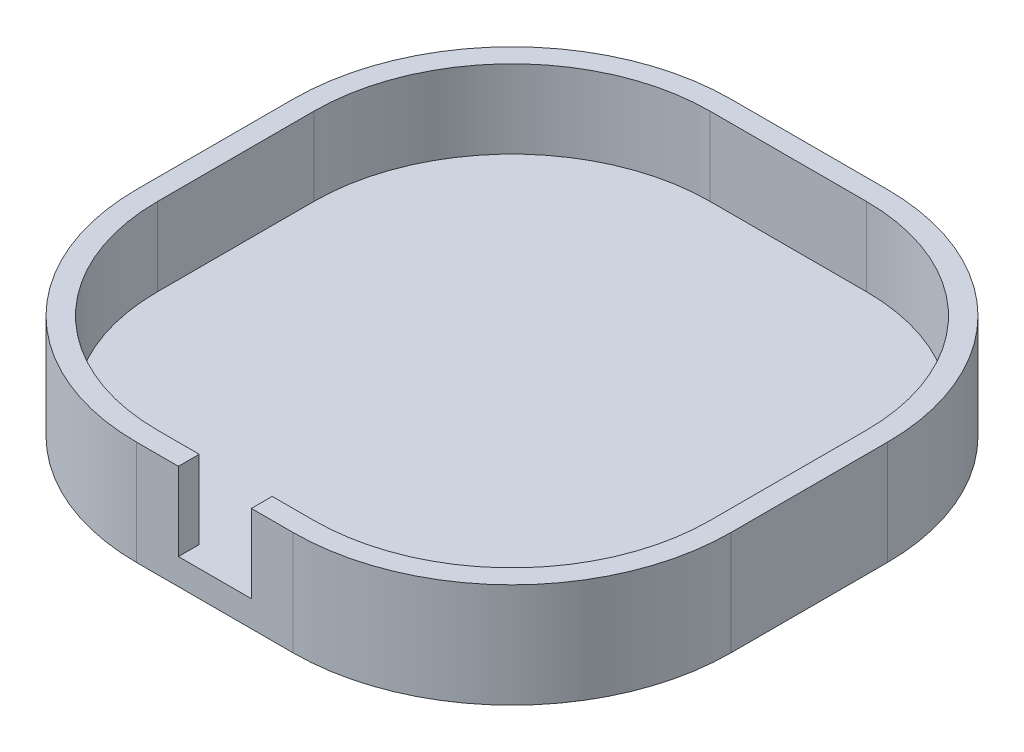
ISO-10303-21;
HEADER;
FILE_DESCRIPTION(('STEP AP214'),'2;1');
FILE_NAME('part.step','',(''),(''),'','','');
FILE_SCHEMA(('AUTOMOTIVE_DESIGN { 1 0 10303 214 1 1 1 1 }'));
ENDSEC;
DATA;
#1=APPLICATION_CONTEXT('core data for automotive mechanical design processes');
#2=APPLICATION_PROTOCOL_DEFINITION('international standard','automotive_design',2000,#1);
#3=PRODUCT_CONTEXT('',#1,'mechanical');
#4=PRODUCT('Part','Part','',(#3));
#5=PRODUCT_RELATED_PRODUCT_CATEGORY('part','',(#4));
#6=PRODUCT_DEFINITION_FORMATION('','',#4);
#7=PRODUCT_DEFINITION_CONTEXT('part definition',#1,'design');
#8=PRODUCT_DEFINITION('design','',#6,#7);
#9=PRODUCT_DEFINITION_SHAPE('','',#8);
#10=(LENGTH_UNIT() NAMED_UNIT(*) SI_UNIT(.MILLI.,.METRE.));
#11=(NAMED_UNIT(*) PLANE_ANGLE_UNIT() SI_UNIT($,.RADIAN.));
#12=(NAMED_UNIT(*) SI_UNIT($,.STERADIAN.) SOLID_ANGLE_UNIT());
#13=UNCERTAINTY_MEASURE_WITH_UNIT(LENGTH_MEASURE(1.E-05),#10,'distance_accuracy_value','');
#14=(GEOMETRIC_REPRESENTATION_CONTEXT(3) GLOBAL_UNCERTAINTY_ASSIGNED_CONTEXT((#13)) GLOBAL_UNIT_ASSIGNED_CONTEXT((#10,
#11,#12)) REPRESENTATION_CONTEXT('',''));
#15=CARTESIAN_POINT('',(0.,0.,0.));
#16=DIRECTION('',(0.,0.,1.));
#17=DIRECTION('',(1.,0.,0.));
#18=AXIS2_PLACEMENT_3D('',#15,#16,#17);
#19=CARTESIAN_POINT('',(-15.,20.,53.));
#20=DIRECTION('',(0.,0.,-1.));
#21=DIRECTION('',(-1.,0.,0.));
#22=AXIS2_PLACEMENT_3D('',#19,#20,#21);
#23=PLANE('',#22);
#24=DIRECTION('',(0.,1.,0.));
#25=VECTOR('',#24,1.);
#26=CARTESIAN_POINT('',(7.00000000000001,-9.56021977856105,53.));
#27=LINE('',#26,#25);
#28=CARTESIAN_POINT('',(7.00000000000001,5.,53.));
#29=VERTEX_POINT('',#28);
#30=CARTESIAN_POINT('',(7.00000000000001,20.,53.));
#31=VERTEX_POINT('',#30);
#32=EDGE_CURVE('E174',#29,#31,#27,.T.);
#33=ORIENTED_EDGE('',*,*,#32,.T.);
#34=DIRECTION('',(1.,0.,0.));
#35=VECTOR('',#34,1.);
#36=CARTESIAN_POINT('',(-15.,20.,53.));
#37=LINE('',#36,#35);
#38=CARTESIAN_POINT('',(15.,20.,53.));
#39=VERTEX_POINT('',#38);
#40=EDGE_CURVE('E206',#31,#39,#37,.T.);
#41=ORIENTED_EDGE('',*,*,#40,.T.);
#42=DIRECTION('',(0.,-1.,0.));
#43=VECTOR('',#42,1.);
#44=CARTESIAN_POINT('',(15.,20.,53.));
#45=LINE('',#44,#43);
#46=CARTESIAN_POINT('',(15.,5.,53.));
#47=VERTEX_POINT('',#46);
#48=EDGE_CURVE('E247',#39,#47,#45,.T.);
#49=ORIENTED_EDGE('',*,*,#48,.T.);
#50=DIRECTION('',(1.,0.,0.));
#51=VECTOR('',#50,1.);
#52=CARTESIAN_POINT('',(-15.,5.,53.));
#53=LINE('',#52,#51);
#54=EDGE_CURVE('E227',#29,#47,#53,.T.);
#55=ORIENTED_EDGE('',*,*,#54,.F.);
#56=EDGE_LOOP('',(#33,#41,#49,#55));
#57=FACE_BOUND('',#56,.T.);
#58=ADVANCED_FACE('F33',(#57),#23,.T.);
#59=CARTESIAN_POINT('',(-15.,5.,-15.));
#60=DIRECTION('',(0.,-1.,0.));
#61=DIRECTION('',(0.,0.,-1.));
#62=AXIS2_PLACEMENT_3D('',#59,#60,#61);
#63=CYLINDRICAL_SURFACE('',#62,42.);
#64=CARTESIAN_POINT('',(-15.,0.,-15.));
#65=DIRECTION('',(0.,1.,0.));
#66=DIRECTION('',(0.,0.,-1.));
#67=AXIS2_PLACEMENT_3D('',#64,#65,#66);
#68=CIRCLE('',#67,42.);
#69=CARTESIAN_POINT('',(-15.,0.,-57.));
#70=VERTEX_POINT('',#69);
#71=CARTESIAN_POINT('',(-57.,0.,-15.));
#72=VERTEX_POINT('',#71);
#73=EDGE_CURVE('E281',#70,#72,#68,.T.);
#74=ORIENTED_EDGE('',*,*,#73,.T.);
#75=DIRECTION('',(0.,-1.,0.));
#76=VECTOR('',#75,1.);
#77=CARTESIAN_POINT('',(-57.,5.,-15.));
#78=LINE('',#77,#76);
#79=CARTESIAN_POINT('',(-57.,20.,-15.));
#80=VERTEX_POINT('',#79);
#81=EDGE_CURVE('E11',#80,#72,#78,.T.);
#82=ORIENTED_EDGE('',*,*,#81,.F.);
#83=CARTESIAN_POINT('',(-15.,20.,-15.));
#84=DIRECTION('',(0.,1.,0.));
#85=DIRECTION('',(0.,0.,1.));
#86=AXIS2_PLACEMENT_3D('',#83,#84,#85);
#87=CIRCLE('',#86,42.);
#88=CARTESIAN_POINT('',(-15.,20.,-57.));
#89=VERTEX_POINT('',#88);
#90=EDGE_CURVE('E263',#89,#80,#87,.T.);
#91=ORIENTED_EDGE('',*,*,#90,.F.);
#92=DIRECTION('',(0.,-1.,0.));
#93=VECTOR('',#92,1.);
#94=CARTESIAN_POINT('',(-15.,5.,-57.));
#95=LINE('',#94,#93);
#96=EDGE_CURVE('E298',#89,#70,#95,.T.);
#97=ORIENTED_EDGE('',*,*,#96,.T.);
#98=EDGE_LOOP('',(#74,#82,#91,#97));
#99=FACE_BOUND('',#98,.T.);
#100=ADVANCED_FACE('F35',(#99),#63,.T.);
#101=CARTESIAN_POINT('',(-57.,5.,15.));
#102=DIRECTION('',(1.,0.,0.));
#103=DIRECTION('',(0.,0.,-1.));
#104=AXIS2_PLACEMENT_3D('',#101,#102,#103);
#105=PLANE('',#104);
#106=DIRECTION('',(0.,0.,1.));
#107=VECTOR('',#106,1.);
#108=CARTESIAN_POINT('',(-57.,0.,15.));
#109=LINE('',#108,#107);
#110=CARTESIAN_POINT('',(-57.,0.,15.));
#111=VERTEX_POINT('',#110);
#112=EDGE_CURVE('E284',#72,#111,#109,.T.);
#113=ORIENTED_EDGE('',*,*,#112,.T.);
#114=DIRECTION('',(0.,-1.,0.));
#115=VECTOR('',#114,1.);
#116=CARTESIAN_POINT('',(-57.,5.,15.));
#117=LINE('',#116,#115);
#118=CARTESIAN_POINT('',(-57.,20.,15.));
#119=VERTEX_POINT('',#118);
#120=EDGE_CURVE('E41',#119,#111,#117,.T.);
#121=ORIENTED_EDGE('',*,*,#120,.F.);
#122=DIRECTION('',(0.,0.,1.));
#123=VECTOR('',#122,1.);
#124=CARTESIAN_POINT('',(-57.,20.,-15.));
#125=LINE('',#124,#123);
#126=EDGE_CURVE('E266',#80,#119,#125,.T.);
#127=ORIENTED_EDGE('',*,*,#126,.F.);
#128=ORIENTED_EDGE('',*,*,#81,.T.);
#129=EDGE_LOOP('',(#113,#121,#127,#128));
#130=FACE_BOUND('',#129,.T.);
#131=ADVANCED_FACE('F347',(#130),#105,.F.);
#132=CARTESIAN_POINT('',(-15.,5.,15.));
#133=DIRECTION('',(0.,-1.,0.));
#134=DIRECTION('',(0.,0.,-1.));
#135=AXIS2_PLACEMENT_3D('',#132,#133,#134);
#136=CYLINDRICAL_SURFACE('',#135,42.);
#137=CARTESIAN_POINT('',(-15.,0.,15.));
#138=DIRECTION('',(0.,1.,0.));
#139=DIRECTION('',(0.,0.,-1.));
#140=AXIS2_PLACEMENT_3D('',#137,#138,#139);
#141=CIRCLE('',#140,42.);
#142=CARTESIAN_POINT('',(-15.,0.,57.));
#143=VERTEX_POINT('',#142);
#144=EDGE_CURVE('E286',#111,#143,#141,.T.);
#145=ORIENTED_EDGE('',*,*,#144,.T.);
#146=DIRECTION('',(0.,-1.,0.));
#147=VECTOR('',#146,1.);
#148=CARTESIAN_POINT('',(-15.,5.,57.));
#149=LINE('',#148,#147);
#150=CARTESIAN_POINT('',(-15.,20.,57.));
#151=VERTEX_POINT('',#150);
#152=EDGE_CURVE('E313',#151,#143,#149,.T.);
#153=ORIENTED_EDGE('',*,*,#152,.F.);
#154=CARTESIAN_POINT('',(-15.,20.,15.));
#155=DIRECTION('',(0.,1.,0.));
#156=DIRECTION('',(0.,0.,1.));
#157=AXIS2_PLACEMENT_3D('',#154,#155,#156);
#158=CIRCLE('',#157,42.);
#159=EDGE_CURVE('E269',#119,#151,#158,.T.);
#160=ORIENTED_EDGE('',*,*,#159,.F.);
#161=ORIENTED_EDGE('',*,*,#120,.T.);
#162=EDGE_LOOP('',(#145,#153,#160,#161));
#163=FACE_BOUND('',#162,.T.);
#164=ADVANCED_FACE('F319',(#163),#136,.T.);
#165=CARTESIAN_POINT('',(-15.,5.,57.));
#166=DIRECTION('',(0.,0.,-1.));
#167=DIRECTION('',(-1.,0.,0.));
#168=AXIS2_PLACEMENT_3D('',#165,#166,#167);
#169=PLANE('',#168);
#170=DIRECTION('',(1.,0.,0.));
#171=VECTOR('',#170,1.);
#172=CARTESIAN_POINT('',(-15.,20.,57.));
#173=LINE('',#172,#171);
#174=CARTESIAN_POINT('',(7.00000000000001,20.,57.));
#175=VERTEX_POINT('',#174);
#176=CARTESIAN_POINT('',(15.,20.,57.));
#177=VERTEX_POINT('',#176);
#178=EDGE_CURVE('E191',#175,#177,#173,.T.);
#179=ORIENTED_EDGE('',*,*,#178,.F.);
#180=DIRECTION('',(0.,1.,0.));
#181=VECTOR('',#180,1.);
#182=CARTESIAN_POINT('',(7.00000000000001,-9.56021977856105,57.));
#183=LINE('',#182,#181);
#184=CARTESIAN_POINT('',(7.00000000000001,5.,57.));
#185=VERTEX_POINT('',#184);
#186=EDGE_CURVE('E171',#185,#175,#183,.T.);
#187=ORIENTED_EDGE('',*,*,#186,.F.);
#188=DIRECTION('',(1.,0.,0.));
#189=VECTOR('',#188,1.);
#190=CARTESIAN_POINT('',(-7.,5.,57.));
#191=LINE('',#190,#189);
#192=CARTESIAN_POINT('',(-7.,5.,57.));
#193=VERTEX_POINT('',#192);
#194=EDGE_CURVE('E178',#193,#185,#191,.T.);
#195=ORIENTED_EDGE('',*,*,#194,.F.);
#196=DIRECTION('',(0.,1.,0.));
#197=VECTOR('',#196,1.);
#198=CARTESIAN_POINT('',(-7.,-9.56021977856105,57.));
#199=LINE('',#198,#197);
#200=CARTESIAN_POINT('',(-7.,20.,57.));
#201=VERTEX_POINT('',#200);
#202=EDGE_CURVE('E196',#193,#201,#199,.T.);
#203=ORIENTED_EDGE('',*,*,#202,.T.);
#204=EDGE_CURVE('E272',#151,#201,#173,.T.);
#205=ORIENTED_EDGE('',*,*,#204,.F.);
#206=ORIENTED_EDGE('',*,*,#152,.T.);
#207=DIRECTION('',(1.,0.,0.));
#208=VECTOR('',#207,1.);
#209=CARTESIAN_POINT('',(-15.,0.,57.));
#210=LINE('',#209,#208);
#211=CARTESIAN_POINT('',(15.,0.,57.));
#212=VERTEX_POINT('',#211);
#213=EDGE_CURVE('E288',#143,#212,#210,.T.);
#214=ORIENTED_EDGE('',*,*,#213,.T.);
#215=DIRECTION('',(0.,-1.,0.));
#216=VECTOR('',#215,1.);
#217=CARTESIAN_POINT('',(15.,5.,57.));
#218=LINE('',#217,#216);
#219=EDGE_CURVE('E310',#177,#212,#218,.T.);
#220=ORIENTED_EDGE('',*,*,#219,.F.);
#221=EDGE_LOOP('',(#179,#187,#195,#203,#205,#206,#214,#220));
#222=FACE_BOUND('',#221,.T.);
#223=ADVANCED_FACE('F189',(#222),#169,.F.);
#224=CARTESIAN_POINT('',(15.,5.,15.));
#225=DIRECTION('',(0.,-1.,0.));
#226=DIRECTION('',(0.,0.,-1.));
#227=AXIS2_PLACEMENT_3D('',#224,#225,#226);
#228=CYLINDRICAL_SURFACE('',#227,42.);
#229=CARTESIAN_POINT('',(15.,0.,15.));
#230=DIRECTION('',(0.,1.,0.));
#231=DIRECTION('',(0.,0.,-1.));
#232=AXIS2_PLACEMENT_3D('',#229,#230,#231);
#233=CIRCLE('',#232,42.);
#234=CARTESIAN_POINT('',(57.,0.,15.));
#235=VERTEX_POINT('',#234);
#236=EDGE_CURVE('E290',#212,#235,#233,.T.);
#237=ORIENTED_EDGE('',*,*,#236,.T.);
#238=DIRECTION('',(0.,-1.,0.));
#239=VECTOR('',#238,1.);
#240=CARTESIAN_POINT('',(57.,5.,15.));
#241=LINE('',#240,#239);
#242=CARTESIAN_POINT('',(57.,20.,15.));
#243=VERTEX_POINT('',#242);
#244=EDGE_CURVE('E307',#243,#235,#241,.T.);
#245=ORIENTED_EDGE('',*,*,#244,.F.);
#246=CARTESIAN_POINT('',(15.,20.,15.));
#247=DIRECTION('',(0.,1.,0.));
#248=DIRECTION('',(0.,0.,1.));
#249=AXIS2_PLACEMENT_3D('',#246,#247,#248);
#250=CIRCLE('',#249,42.);
#251=EDGE_CURVE('E275',#177,#243,#250,.T.);
#252=ORIENTED_EDGE('',*,*,#251,.F.);
#253=ORIENTED_EDGE('',*,*,#219,.T.);
#254=EDGE_LOOP('',(#237,#245,#252,#253));
#255=FACE_BOUND('',#254,.T.);
#256=ADVANCED_FACE('F331',(#255),#228,.T.);
#257=CARTESIAN_POINT('',(57.,5.,15.));
#258=DIRECTION('',(-1.,0.,0.));
#259=DIRECTION('',(0.,0.,1.));
#260=AXIS2_PLACEMENT_3D('',#257,#258,#259);
#261=PLANE('',#260);
#262=DIRECTION('',(0.,0.,-1.));
#263=VECTOR('',#262,1.);
#264=CARTESIAN_POINT('',(57.,0.,15.));
#265=LINE('',#264,#263);
#266=CARTESIAN_POINT('',(57.,0.,-15.));
#267=VERTEX_POINT('',#266);
#268=EDGE_CURVE('E292',#235,#267,#265,.T.);
#269=ORIENTED_EDGE('',*,*,#268,.T.);
#270=DIRECTION('',(0.,-1.,0.));
#271=VECTOR('',#270,1.);
#272=CARTESIAN_POINT('',(57.,5.,-15.));
#273=LINE('',#272,#271);
#274=CARTESIAN_POINT('',(57.,20.,-15.));
#275=VERTEX_POINT('',#274);
#276=EDGE_CURVE('E304',#275,#267,#273,.T.);
#277=ORIENTED_EDGE('',*,*,#276,.F.);
#278=DIRECTION('',(0.,0.,-1.));
#279=VECTOR('',#278,1.);
#280=CARTESIAN_POINT('',(57.,20.,15.));
#281=LINE('',#280,#279);
#282=EDGE_CURVE('E278',#243,#275,#281,.T.);
#283=ORIENTED_EDGE('',*,*,#282,.F.);
#284=ORIENTED_EDGE('',*,*,#244,.T.);
#285=EDGE_LOOP('',(#269,#277,#283,#284));
#286=FACE_BOUND('',#285,.T.);
#287=ADVANCED_FACE('F337',(#286),#261,.F.);
#288=CARTESIAN_POINT('',(15.,5.,-15.));
#289=DIRECTION('',(0.,-1.,0.));
#290=DIRECTION('',(0.,0.,-1.));
#291=AXIS2_PLACEMENT_3D('',#288,#289,#290);
#292=CYLINDRICAL_SURFACE('',#291,42.);
#293=CARTESIAN_POINT('',(15.,0.,-15.));
#294=DIRECTION('',(0.,1.,0.));
#295=DIRECTION('',(0.,0.,1.));
#296=AXIS2_PLACEMENT_3D('',#293,#294,#295);
#297=CIRCLE('',#296,42.);
#298=CARTESIAN_POINT('',(15.,0.,-57.));
#299=VERTEX_POINT('',#298);
#300=EDGE_CURVE('E294',#267,#299,#297,.T.);
#301=ORIENTED_EDGE('',*,*,#300,.T.);
#302=DIRECTION('',(0.,-1.,0.));
#303=VECTOR('',#302,1.);
#304=CARTESIAN_POINT('',(15.,5.,-57.));
#305=LINE('',#304,#303);
#306=CARTESIAN_POINT('',(15.,20.,-57.));
#307=VERTEX_POINT('',#306);
#308=EDGE_CURVE('E301',#307,#299,#305,.T.);
#309=ORIENTED_EDGE('',*,*,#308,.F.);
#310=CARTESIAN_POINT('',(15.,20.,-15.));
#311=DIRECTION('',(0.,1.,0.));
#312=DIRECTION('',(0.,0.,1.));
#313=AXIS2_PLACEMENT_3D('',#310,#311,#312);
#314=CIRCLE('',#313,42.);
#315=EDGE_CURVE('E257',#275,#307,#314,.T.);
#316=ORIENTED_EDGE('',*,*,#315,.F.);
#317=ORIENTED_EDGE('',*,*,#276,.T.);
#318=EDGE_LOOP('',(#301,#309,#316,#317));
#319=FACE_BOUND('',#318,.T.);
#320=ADVANCED_FACE('F340',(#319),#292,.T.);
#321=CARTESIAN_POINT('',(-15.,5.,-57.));
#322=DIRECTION('',(0.,0.,1.));
#323=DIRECTION('',(1.,0.,0.));
#324=AXIS2_PLACEMENT_3D('',#321,#322,#323);
#325=PLANE('',#324);
#326=DIRECTION('',(-1.,0.,0.));
#327=VECTOR('',#326,1.);
#328=CARTESIAN_POINT('',(-15.,0.,-57.));
#329=LINE('',#328,#327);
#330=EDGE_CURVE('E296',#299,#70,#329,.T.);
#331=ORIENTED_EDGE('',*,*,#330,.T.);
#332=ORIENTED_EDGE('',*,*,#96,.F.);
#333=DIRECTION('',(-1.,0.,0.));
#334=VECTOR('',#333,1.);
#335=CARTESIAN_POINT('',(15.,20.,-57.));
#336=LINE('',#335,#334);
#337=EDGE_CURVE('E260',#307,#89,#336,.T.);
#338=ORIENTED_EDGE('',*,*,#337,.F.);
#339=ORIENTED_EDGE('',*,*,#308,.T.);
#340=EDGE_LOOP('',(#331,#332,#338,#339));
#341=FACE_BOUND('',#340,.T.);
#342=ADVANCED_FACE('F343',(#341),#325,.F.);
#343=CARTESIAN_POINT('',(-15.,0.,-15.));
#344=DIRECTION('',(0.,-1.,0.));
#345=DIRECTION('',(0.,0.,-1.));
#346=AXIS2_PLACEMENT_3D('',#343,#344,#345);
#347=PLANE('',#346);
#348=ORIENTED_EDGE('',*,*,#73,.F.);
#349=ORIENTED_EDGE('',*,*,#330,.F.);
#350=ORIENTED_EDGE('',*,*,#300,.F.);
#351=ORIENTED_EDGE('',*,*,#268,.F.);
#352=ORIENTED_EDGE('',*,*,#236,.F.);
#353=ORIENTED_EDGE('',*,*,#213,.F.);
#354=ORIENTED_EDGE('',*,*,#144,.F.);
#355=ORIENTED_EDGE('',*,*,#112,.F.);
#356=EDGE_LOOP('',(#348,#349,#350,#351,#352,#353,#354,#355));
#357=FACE_BOUND('',#356,.T.);
#358=ADVANCED_FACE('F325',(#357),#347,.T.);
#359=CARTESIAN_POINT('',(15.,20.,-15.));
#360=DIRECTION('',(0.,1.,0.));
#361=DIRECTION('',(0.,0.,1.));
#362=AXIS2_PLACEMENT_3D('',#359,#360,#361);
#363=PLANE('',#362);
#364=DIRECTION('',(0.,0.,-1.));
#365=VECTOR('',#364,1.);
#366=CARTESIAN_POINT('',(7.00000000000001,20.,53.));
#367=LINE('',#366,#365);
#368=EDGE_CURVE('E186',#175,#31,#367,.T.);
#369=ORIENTED_EDGE('',*,*,#368,.F.);
#370=ORIENTED_EDGE('',*,*,#178,.T.);
#371=ORIENTED_EDGE('',*,*,#251,.T.);
#372=ORIENTED_EDGE('',*,*,#282,.T.);
#373=ORIENTED_EDGE('',*,*,#315,.T.);
#374=ORIENTED_EDGE('',*,*,#337,.T.);
#375=ORIENTED_EDGE('',*,*,#90,.T.);
#376=ORIENTED_EDGE('',*,*,#126,.T.);
#377=ORIENTED_EDGE('',*,*,#159,.T.);
#378=ORIENTED_EDGE('',*,*,#204,.T.);
#379=DIRECTION('',(0.,0.,1.));
#380=VECTOR('',#379,1.);
#381=CARTESIAN_POINT('',(-7.,20.,53.));
#382=LINE('',#381,#380);
#383=CARTESIAN_POINT('',(-7.,20.,53.));
#384=VERTEX_POINT('',#383);
#385=EDGE_CURVE('E385',#384,#201,#382,.T.);
#386=ORIENTED_EDGE('',*,*,#385,.F.);
#387=CARTESIAN_POINT('',(-15.,20.,53.));
#388=VERTEX_POINT('',#387);
#389=EDGE_CURVE('E207',#388,#384,#37,.T.);
#390=ORIENTED_EDGE('',*,*,#389,.F.);
#391=CARTESIAN_POINT('',(-15.,20.,15.));
#392=DIRECTION('',(0.,1.,0.));
#393=DIRECTION('',(0.,0.,1.));
#394=AXIS2_PLACEMENT_3D('',#391,#392,#393);
#395=CIRCLE('',#394,38.);
#396=CARTESIAN_POINT('',(-53.,20.,15.));
#397=VERTEX_POINT('',#396);
#398=EDGE_CURVE('E204',#397,#388,#395,.T.);
#399=ORIENTED_EDGE('',*,*,#398,.F.);
#400=DIRECTION('',(0.,0.,1.));
#401=VECTOR('',#400,1.);
#402=CARTESIAN_POINT('',(-53.,20.,-15.));
#403=LINE('',#402,#401);
#404=CARTESIAN_POINT('',(-53.,20.,-15.));
#405=VERTEX_POINT('',#404);
#406=EDGE_CURVE('E201',#405,#397,#403,.T.);
#407=ORIENTED_EDGE('',*,*,#406,.F.);
#408=CARTESIAN_POINT('',(-15.,20.,-15.));
#409=DIRECTION('',(0.,1.,0.));
#410=DIRECTION('',(0.,0.,1.));
#411=AXIS2_PLACEMENT_3D('',#408,#409,#410);
#412=CIRCLE('',#411,38.);
#413=CARTESIAN_POINT('',(-15.,20.,-53.));
#414=VERTEX_POINT('',#413);
#415=EDGE_CURVE('E199',#414,#405,#412,.T.);
#416=ORIENTED_EDGE('',*,*,#415,.F.);
#417=DIRECTION('',(-1.,0.,0.));
#418=VECTOR('',#417,1.);
#419=CARTESIAN_POINT('',(15.,20.,-53.));
#420=LINE('',#419,#418);
#421=CARTESIAN_POINT('',(15.,20.,-53.));
#422=VERTEX_POINT('',#421);
#423=EDGE_CURVE('E217',#422,#414,#420,.T.);
#424=ORIENTED_EDGE('',*,*,#423,.F.);
#425=CARTESIAN_POINT('',(15.,20.,-15.));
#426=DIRECTION('',(0.,1.,0.));
#427=DIRECTION('',(0.,0.,1.));
#428=AXIS2_PLACEMENT_3D('',#425,#426,#427);
#429=CIRCLE('',#428,38.);
#430=CARTESIAN_POINT('',(53.,20.,-15.));
#431=VERTEX_POINT('',#430);
#432=EDGE_CURVE('E214',#431,#422,#429,.T.);
#433=ORIENTED_EDGE('',*,*,#432,.F.);
#434=DIRECTION('',(0.,0.,-1.));
#435=VECTOR('',#434,1.);
#436=CARTESIAN_POINT('',(53.,20.,15.));
#437=LINE('',#436,#435);
#438=CARTESIAN_POINT('',(53.,20.,15.));
#439=VERTEX_POINT('',#438);
#440=EDGE_CURVE('E212',#439,#431,#437,.T.);
#441=ORIENTED_EDGE('',*,*,#440,.F.);
#442=CARTESIAN_POINT('',(15.,20.,15.));
#443=DIRECTION('',(0.,1.,0.));
#444=DIRECTION('',(0.,0.,1.));
#445=AXIS2_PLACEMENT_3D('',#442,#443,#444);
#446=CIRCLE('',#445,38.);
#447=EDGE_CURVE('E210',#39,#439,#446,.T.);
#448=ORIENTED_EDGE('',*,*,#447,.F.);
#449=ORIENTED_EDGE('',*,*,#40,.F.);
#450=EDGE_LOOP('',(#369,#370,#371,#372,#373,#374,#375,#376,#377,#378,#386,#390,#399,#407,#416,
#424,#433,#441,#448,#449));
#451=FACE_BOUND('',#450,.T.);
#452=ADVANCED_FACE('F334',(#451),#363,.T.);
#453=CARTESIAN_POINT('',(-15.,20.,-15.));
#454=DIRECTION('',(0.,-1.,0.));
#455=DIRECTION('',(0.,0.,-1.));
#456=AXIS2_PLACEMENT_3D('',#453,#454,#455);
#457=CYLINDRICAL_SURFACE('',#456,38.);
#458=CARTESIAN_POINT('',(-15.,5.,-15.));
#459=DIRECTION('',(0.,1.,0.));
#460=DIRECTION('',(0.,0.,1.));
#461=AXIS2_PLACEMENT_3D('',#458,#459,#460);
#462=CIRCLE('',#461,38.);
#463=CARTESIAN_POINT('',(-15.,5.,-53.));
#464=VERTEX_POINT('',#463);
#465=CARTESIAN_POINT('',(-53.,5.,-15.));
#466=VERTEX_POINT('',#465);
#467=EDGE_CURVE('E198',#464,#466,#462,.T.);
#468=ORIENTED_EDGE('',*,*,#467,.F.);
#469=DIRECTION('',(0.,-1.,0.));
#470=VECTOR('',#469,1.);
#471=CARTESIAN_POINT('',(-15.,20.,-53.));
#472=LINE('',#471,#470);
#473=EDGE_CURVE('E56',#414,#464,#472,.T.);
#474=ORIENTED_EDGE('',*,*,#473,.F.);
#475=ORIENTED_EDGE('',*,*,#415,.T.);
#476=DIRECTION('',(0.,-1.,0.));
#477=VECTOR('',#476,1.);
#478=CARTESIAN_POINT('',(-53.,20.,-15.));
#479=LINE('',#478,#477);
#480=EDGE_CURVE('E254',#405,#466,#479,.T.);
#481=ORIENTED_EDGE('',*,*,#480,.T.);
#482=EDGE_LOOP('',(#468,#474,#475,#481));
#483=FACE_BOUND('',#482,.T.);
#484=ADVANCED_FACE('F453',(#483),#457,.F.);
#485=CARTESIAN_POINT('',(-53.,20.,-15.));
#486=DIRECTION('',(1.,0.,0.));
#487=DIRECTION('',(0.,0.,-1.));
#488=AXIS2_PLACEMENT_3D('',#485,#486,#487);
#489=PLANE('',#488);
#490=DIRECTION('',(0.,0.,1.));
#491=VECTOR('',#490,1.);
#492=CARTESIAN_POINT('',(-53.,5.,-15.));
#493=LINE('',#492,#491);
#494=CARTESIAN_POINT('',(-53.,5.,15.));
#495=VERTEX_POINT('',#494);
#496=EDGE_CURVE('E221',#466,#495,#493,.T.);
#497=ORIENTED_EDGE('',*,*,#496,.F.);
#498=ORIENTED_EDGE('',*,*,#480,.F.);
#499=ORIENTED_EDGE('',*,*,#406,.T.);
#500=DIRECTION('',(0.,-1.,0.));
#501=VECTOR('',#500,1.);
#502=CARTESIAN_POINT('',(-53.,20.,15.));
#503=LINE('',#502,#501);
#504=EDGE_CURVE('E252',#397,#495,#503,.T.);
#505=ORIENTED_EDGE('',*,*,#504,.T.);
#506=EDGE_LOOP('',(#497,#498,#499,#505));
#507=FACE_BOUND('',#506,.T.);
#508=ADVANCED_FACE('F372',(#507),#489,.T.);
#509=CARTESIAN_POINT('',(-15.,20.,15.));
#510=DIRECTION('',(0.,-1.,0.));
#511=DIRECTION('',(0.,0.,-1.));
#512=AXIS2_PLACEMENT_3D('',#509,#510,#511);
#513=CYLINDRICAL_SURFACE('',#512,38.);
#514=CARTESIAN_POINT('',(-15.,5.,15.));
#515=DIRECTION('',(0.,1.,0.));
#516=DIRECTION('',(0.,0.,1.));
#517=AXIS2_PLACEMENT_3D('',#514,#515,#516);
#518=CIRCLE('',#517,38.);
#519=CARTESIAN_POINT('',(-15.,5.,53.));
#520=VERTEX_POINT('',#519);
#521=EDGE_CURVE('E224',#495,#520,#518,.T.);
#522=ORIENTED_EDGE('',*,*,#521,.F.);
#523=ORIENTED_EDGE('',*,*,#504,.F.);
#524=ORIENTED_EDGE('',*,*,#398,.T.);
#525=DIRECTION('',(0.,-1.,0.));
#526=VECTOR('',#525,1.);
#527=CARTESIAN_POINT('',(-15.,20.,53.));
#528=LINE('',#527,#526);
#529=EDGE_CURVE('E250',#388,#520,#528,.T.);
#530=ORIENTED_EDGE('',*,*,#529,.T.);
#531=EDGE_LOOP('',(#522,#523,#524,#530));
#532=FACE_BOUND('',#531,.T.);
#533=ADVANCED_FACE('F364',(#532),#513,.F.);
#534=DIRECTION('',(0.,1.,0.));
#535=VECTOR('',#534,1.);
#536=CARTESIAN_POINT('',(-7.,-9.56021977856105,53.));
#537=LINE('',#536,#535);
#538=CARTESIAN_POINT('',(-7.,5.,53.));
#539=VERTEX_POINT('',#538);
#540=EDGE_CURVE('E376',#539,#384,#537,.T.);
#541=ORIENTED_EDGE('',*,*,#540,.F.);
#542=EDGE_CURVE('E228',#520,#539,#53,.T.);
#543=ORIENTED_EDGE('',*,*,#542,.F.);
#544=ORIENTED_EDGE('',*,*,#529,.F.);
#545=ORIENTED_EDGE('',*,*,#389,.T.);
#546=EDGE_LOOP('',(#541,#543,#544,#545));
#547=FACE_BOUND('',#546,.T.);
#548=ADVANCED_FACE('F357',(#547),#23,.T.);
#549=CARTESIAN_POINT('',(15.,20.,15.));
#550=DIRECTION('',(0.,-1.,0.));
#551=DIRECTION('',(0.,0.,-1.));
#552=AXIS2_PLACEMENT_3D('',#549,#550,#551);
#553=CYLINDRICAL_SURFACE('',#552,38.);
#554=CARTESIAN_POINT('',(15.,5.,15.));
#555=DIRECTION('',(0.,1.,0.));
#556=DIRECTION('',(0.,0.,1.));
#557=AXIS2_PLACEMENT_3D('',#554,#555,#556);
#558=CIRCLE('',#557,38.);
#559=CARTESIAN_POINT('',(53.,5.,15.));
#560=VERTEX_POINT('',#559);
#561=EDGE_CURVE('E230',#47,#560,#558,.T.);
#562=ORIENTED_EDGE('',*,*,#561,.F.);
#563=ORIENTED_EDGE('',*,*,#48,.F.);
#564=ORIENTED_EDGE('',*,*,#447,.T.);
#565=DIRECTION('',(0.,-1.,0.));
#566=VECTOR('',#565,1.);
#567=CARTESIAN_POINT('',(53.,20.,15.));
#568=LINE('',#567,#566);
#569=EDGE_CURVE('E245',#439,#560,#568,.T.);
#570=ORIENTED_EDGE('',*,*,#569,.T.);
#571=EDGE_LOOP('',(#562,#563,#564,#570));
#572=FACE_BOUND('',#571,.T.);
#573=ADVANCED_FACE('F363',(#572),#553,.F.);
#574=CARTESIAN_POINT('',(53.,20.,15.));
#575=DIRECTION('',(-1.,0.,0.));
#576=DIRECTION('',(0.,0.,1.));
#577=AXIS2_PLACEMENT_3D('',#574,#575,#576);
#578=PLANE('',#577);
#579=DIRECTION('',(0.,0.,-1.));
#580=VECTOR('',#579,1.);
#581=CARTESIAN_POINT('',(53.,5.,15.));
#582=LINE('',#581,#580);
#583=CARTESIAN_POINT('',(53.,5.,-15.));
#584=VERTEX_POINT('',#583);
#585=EDGE_CURVE('E233',#560,#584,#582,.T.);
#586=ORIENTED_EDGE('',*,*,#585,.F.);
#587=ORIENTED_EDGE('',*,*,#569,.F.);
#588=ORIENTED_EDGE('',*,*,#440,.T.);
#589=DIRECTION('',(0.,-1.,0.));
#590=VECTOR('',#589,1.);
#591=CARTESIAN_POINT('',(53.,20.,-15.));
#592=LINE('',#591,#590);
#593=EDGE_CURVE('E243',#431,#584,#592,.T.);
#594=ORIENTED_EDGE('',*,*,#593,.T.);
#595=EDGE_LOOP('',(#586,#587,#588,#594));
#596=FACE_BOUND('',#595,.T.);
#597=ADVANCED_FACE('F370',(#596),#578,.T.);
#598=CARTESIAN_POINT('',(15.,20.,-15.));
#599=DIRECTION('',(0.,-1.,0.));
#600=DIRECTION('',(0.,0.,-1.));
#601=AXIS2_PLACEMENT_3D('',#598,#599,#600);
#602=CYLINDRICAL_SURFACE('',#601,38.);
#603=CARTESIAN_POINT('',(15.,5.,-15.));
#604=DIRECTION('',(0.,1.,0.));
#605=DIRECTION('',(0.,0.,1.));
#606=AXIS2_PLACEMENT_3D('',#603,#604,#605);
#607=CIRCLE('',#606,38.);
#608=CARTESIAN_POINT('',(15.,5.,-53.));
#609=VERTEX_POINT('',#608);
#610=EDGE_CURVE('E236',#584,#609,#607,.T.);
#611=ORIENTED_EDGE('',*,*,#610,.F.);
#612=ORIENTED_EDGE('',*,*,#593,.F.);
#613=ORIENTED_EDGE('',*,*,#432,.T.);
#614=DIRECTION('',(0.,-1.,0.));
#615=VECTOR('',#614,1.);
#616=CARTESIAN_POINT('',(15.,20.,-53.));
#617=LINE('',#616,#615);
#618=EDGE_CURVE('E241',#422,#609,#617,.T.);
#619=ORIENTED_EDGE('',*,*,#618,.T.);
#620=EDGE_LOOP('',(#611,#612,#613,#619));
#621=FACE_BOUND('',#620,.T.);
#622=ADVANCED_FACE('F401',(#621),#602,.F.);
#623=CARTESIAN_POINT('',(15.,20.,-53.));
#624=DIRECTION('',(0.,0.,1.));
#625=DIRECTION('',(1.,0.,0.));
#626=AXIS2_PLACEMENT_3D('',#623,#624,#625);
#627=PLANE('',#626);
#628=DIRECTION('',(-1.,0.,0.));
#629=VECTOR('',#628,1.);
#630=CARTESIAN_POINT('',(15.,5.,-53.));
#631=LINE('',#630,#629);
#632=EDGE_CURVE('E202',#609,#464,#631,.T.);
#633=ORIENTED_EDGE('',*,*,#632,.F.);
#634=ORIENTED_EDGE('',*,*,#618,.F.);
#635=ORIENTED_EDGE('',*,*,#423,.T.);
#636=ORIENTED_EDGE('',*,*,#473,.T.);
#637=EDGE_LOOP('',(#633,#634,#635,#636));
#638=FACE_BOUND('',#637,.T.);
#639=ADVANCED_FACE('F403',(#638),#627,.T.);
#640=CARTESIAN_POINT('',(-15.,5.,-15.));
#641=DIRECTION('',(0.,-1.,0.));
#642=DIRECTION('',(0.,0.,-1.));
#643=AXIS2_PLACEMENT_3D('',#640,#641,#642);
#644=PLANE('',#643);
#645=ORIENTED_EDGE('',*,*,#632,.T.);
#646=ORIENTED_EDGE('',*,*,#467,.T.);
#647=ORIENTED_EDGE('',*,*,#496,.T.);
#648=ORIENTED_EDGE('',*,*,#521,.T.);
#649=ORIENTED_EDGE('',*,*,#542,.T.);
#650=DIRECTION('',(0.,0.,1.));
#651=VECTOR('',#650,1.);
#652=CARTESIAN_POINT('',(-7.,5.,53.));
#653=LINE('',#652,#651);
#654=EDGE_CURVE('E182',#539,#193,#653,.T.);
#655=ORIENTED_EDGE('',*,*,#654,.T.);
#656=ORIENTED_EDGE('',*,*,#194,.T.);
#657=DIRECTION('',(0.,0.,-1.));
#658=VECTOR('',#657,1.);
#659=CARTESIAN_POINT('',(7.00000000000001,5.,53.));
#660=LINE('',#659,#658);
#661=EDGE_CURVE('E48',#185,#29,#660,.T.);
#662=ORIENTED_EDGE('',*,*,#661,.T.);
#663=ORIENTED_EDGE('',*,*,#54,.T.);
#664=ORIENTED_EDGE('',*,*,#561,.T.);
#665=ORIENTED_EDGE('',*,*,#585,.T.);
#666=ORIENTED_EDGE('',*,*,#610,.T.);
#667=EDGE_LOOP('',(#645,#646,#647,#648,#649,#655,#656,#662,#663,#664,#665,#666));
#668=FACE_BOUND('',#667,.T.);
#669=ADVANCED_FACE('F180',(#668),#644,.F.);
#670=CARTESIAN_POINT('',(7.00000000000001,-9.56021977856105,53.));
#671=DIRECTION('',(1.,0.,0.));
#672=DIRECTION('',(0.,0.,-1.));
#673=AXIS2_PLACEMENT_3D('',#670,#671,#672);
#674=PLANE('',#673);
#675=ORIENTED_EDGE('',*,*,#186,.T.);
#676=ORIENTED_EDGE('',*,*,#368,.T.);
#677=ORIENTED_EDGE('',*,*,#32,.F.);
#678=ORIENTED_EDGE('',*,*,#661,.F.);
#679=EDGE_LOOP('',(#675,#676,#677,#678));
#680=FACE_BOUND('',#679,.T.);
#681=ADVANCED_FACE('F169',(#680),#674,.F.);
#682=CARTESIAN_POINT('',(-7.,-9.56021977856105,53.));
#683=DIRECTION('',(-1.,0.,0.));
#684=DIRECTION('',(0.,0.,1.));
#685=AXIS2_PLACEMENT_3D('',#682,#683,#684);
#686=PLANE('',#685);
#687=ORIENTED_EDGE('',*,*,#540,.T.);
#688=ORIENTED_EDGE('',*,*,#385,.T.);
#689=ORIENTED_EDGE('',*,*,#202,.F.);
#690=ORIENTED_EDGE('',*,*,#654,.F.);
#691=EDGE_LOOP('',(#687,#688,#689,#690));
#692=FACE_BOUND('',#691,.T.);
#693=ADVANCED_FACE('F479',(#692),#686,.F.);
#694=CLOSED_SHELL('',(#58,#100,#131,#164,#223,#256,#287,#320,#342,#358,#452,#484,#508,#533,#548,
#573,#597,#622,#639,#669,#681,#693));
#695=MANIFOLD_SOLID_BREP('B2',#694);
#696=ADVANCED_BREP_SHAPE_REPRESENTATION('',(#18,#695),#14);
#697=SHAPE_DEFINITION_REPRESENTATION(#9,#696);
ENDSEC;
END-ISO-10303-21;
